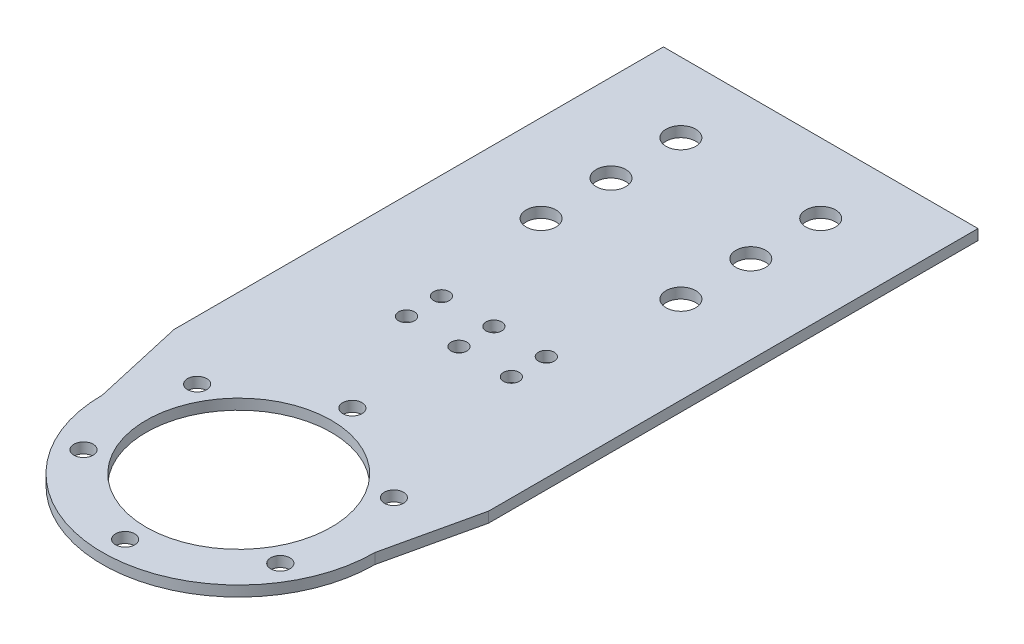
ISO-10303-21;
HEADER;
FILE_DESCRIPTION(('STEP AP214'),'2;1');
FILE_NAME('part.step','',(''),(''),'','','');
FILE_SCHEMA(('AUTOMOTIVE_DESIGN { 1 0 10303 214 1 1 1 1 }'));
ENDSEC;
DATA;
#1=APPLICATION_CONTEXT('core data for automotive mechanical design processes');
#2=APPLICATION_PROTOCOL_DEFINITION('international standard','automotive_design',2000,#1);
#3=PRODUCT_CONTEXT('',#1,'mechanical');
#4=PRODUCT('Part','Part','',(#3));
#5=PRODUCT_RELATED_PRODUCT_CATEGORY('part','',(#4));
#6=PRODUCT_DEFINITION_FORMATION('','',#4);
#7=PRODUCT_DEFINITION_CONTEXT('part definition',#1,'design');
#8=PRODUCT_DEFINITION('design','',#6,#7);
#9=PRODUCT_DEFINITION_SHAPE('','',#8);
#10=(LENGTH_UNIT() NAMED_UNIT(*) SI_UNIT(.MILLI.,.METRE.));
#11=(NAMED_UNIT(*) PLANE_ANGLE_UNIT() SI_UNIT($,.RADIAN.));
#12=(NAMED_UNIT(*) SI_UNIT($,.STERADIAN.) SOLID_ANGLE_UNIT());
#13=UNCERTAINTY_MEASURE_WITH_UNIT(LENGTH_MEASURE(1.E-05),#10,'distance_accuracy_value','');
#14=(GEOMETRIC_REPRESENTATION_CONTEXT(3) GLOBAL_UNCERTAINTY_ASSIGNED_CONTEXT((#13)) GLOBAL_UNIT_ASSIGNED_CONTEXT((#10,
#11,#12)) REPRESENTATION_CONTEXT('',''));
#15=CARTESIAN_POINT('',(0.,0.,0.));
#16=DIRECTION('',(0.,0.,1.));
#17=DIRECTION('',(1.,0.,0.));
#18=AXIS2_PLACEMENT_3D('',#15,#16,#17);
#19=CARTESIAN_POINT('',(20.,-1.5,-106.5));
#20=DIRECTION('',(0.,1.,0.));
#21=DIRECTION('',(0.,0.,1.));
#22=AXIS2_PLACEMENT_3D('',#19,#20,#21);
#23=CYLINDRICAL_SURFACE('',#22,4.25000000000001);
#24=CARTESIAN_POINT('',(20.,1.5,-106.5));
#25=DIRECTION('',(0.,1.,0.));
#26=DIRECTION('',(0.,0.,1.));
#27=AXIS2_PLACEMENT_3D('',#24,#25,#26);
#28=CIRCLE('',#27,4.25000000000001);
#29=CARTESIAN_POINT('',(20.,1.5,-102.25));
#30=VERTEX_POINT('',#29);
#31=EDGE_CURVE('E40',#30,#30,#28,.T.);
#32=ORIENTED_EDGE('',*,*,#31,.T.);
#33=EDGE_LOOP('',(#32));
#34=FACE_BOUND('',#33,.T.);
#35=CARTESIAN_POINT('',(20.,-1.5,-106.5));
#36=DIRECTION('',(0.,1.,0.));
#37=DIRECTION('',(0.,0.,1.));
#38=AXIS2_PLACEMENT_3D('',#35,#36,#37);
#39=CIRCLE('',#38,4.25000000000001);
#40=CARTESIAN_POINT('',(20.,-1.5,-102.25));
#41=VERTEX_POINT('',#40);
#42=EDGE_CURVE('E11',#41,#41,#39,.T.);
#43=ORIENTED_EDGE('',*,*,#42,.F.);
#44=EDGE_LOOP('',(#43));
#45=FACE_BOUND('',#44,.T.);
#46=ADVANCED_FACE('F33',(#34,#45),#23,.F.);
#47=CARTESIAN_POINT('',(-20.,-1.5,-106.5));
#48=DIRECTION('',(0.,1.,0.));
#49=DIRECTION('',(0.,0.,1.));
#50=AXIS2_PLACEMENT_3D('',#47,#48,#49);
#51=CYLINDRICAL_SURFACE('',#50,4.25);
#52=CARTESIAN_POINT('',(-20.,1.5,-106.5));
#53=DIRECTION('',(0.,1.,0.));
#54=DIRECTION('',(0.,0.,1.));
#55=AXIS2_PLACEMENT_3D('',#52,#53,#54);
#56=CIRCLE('',#55,4.25);
#57=CARTESIAN_POINT('',(-20.,1.5,-102.25));
#58=VERTEX_POINT('',#57);
#59=EDGE_CURVE('E135',#58,#58,#56,.T.);
#60=ORIENTED_EDGE('',*,*,#59,.T.);
#61=EDGE_LOOP('',(#60));
#62=FACE_BOUND('',#61,.T.);
#63=CARTESIAN_POINT('',(-20.,-1.5,-106.5));
#64=DIRECTION('',(0.,1.,0.));
#65=DIRECTION('',(0.,0.,1.));
#66=AXIS2_PLACEMENT_3D('',#63,#64,#65);
#67=CIRCLE('',#66,4.25);
#68=CARTESIAN_POINT('',(-20.,-1.5,-102.25));
#69=VERTEX_POINT('',#68);
#70=EDGE_CURVE('E138',#69,#69,#67,.T.);
#71=ORIENTED_EDGE('',*,*,#70,.F.);
#72=EDGE_LOOP('',(#71));
#73=FACE_BOUND('',#72,.T.);
#74=ADVANCED_FACE('F163',(#62,#73),#51,.F.);
#75=CARTESIAN_POINT('',(15.,-1.5,-63.));
#76=DIRECTION('',(0.,1.,0.));
#77=DIRECTION('',(0.,0.,1.));
#78=AXIS2_PLACEMENT_3D('',#75,#76,#77);
#79=CYLINDRICAL_SURFACE('',#78,2.25);
#80=CARTESIAN_POINT('',(15.,1.5,-63.));
#81=DIRECTION('',(0.,1.,0.));
#82=DIRECTION('',(0.,0.,1.));
#83=AXIS2_PLACEMENT_3D('',#80,#81,#82);
#84=CIRCLE('',#83,2.25);
#85=CARTESIAN_POINT('',(15.,1.5,-60.75));
#86=VERTEX_POINT('',#85);
#87=EDGE_CURVE('E129',#86,#86,#84,.T.);
#88=ORIENTED_EDGE('',*,*,#87,.T.);
#89=EDGE_LOOP('',(#88));
#90=FACE_BOUND('',#89,.T.);
#91=CARTESIAN_POINT('',(15.,-1.5,-63.));
#92=DIRECTION('',(0.,1.,0.));
#93=DIRECTION('',(0.,0.,1.));
#94=AXIS2_PLACEMENT_3D('',#91,#92,#93);
#95=CIRCLE('',#94,2.25);
#96=CARTESIAN_POINT('',(15.,-1.5,-60.75));
#97=VERTEX_POINT('',#96);
#98=EDGE_CURVE('E132',#97,#97,#95,.T.);
#99=ORIENTED_EDGE('',*,*,#98,.F.);
#100=EDGE_LOOP('',(#99));
#101=FACE_BOUND('',#100,.T.);
#102=ADVANCED_FACE('F167',(#90,#101),#79,.F.);
#103=CARTESIAN_POINT('',(0.,-1.5,-63.));
#104=DIRECTION('',(0.,1.,0.));
#105=DIRECTION('',(0.,0.,1.));
#106=AXIS2_PLACEMENT_3D('',#103,#104,#105);
#107=CYLINDRICAL_SURFACE('',#106,2.25);
#108=CARTESIAN_POINT('',(0.,1.5,-63.));
#109=DIRECTION('',(0.,1.,0.));
#110=DIRECTION('',(0.,0.,1.));
#111=AXIS2_PLACEMENT_3D('',#108,#109,#110);
#112=CIRCLE('',#111,2.25);
#113=CARTESIAN_POINT('',(0.,1.5,-60.75));
#114=VERTEX_POINT('',#113);
#115=EDGE_CURVE('E122',#114,#114,#112,.T.);
#116=ORIENTED_EDGE('',*,*,#115,.T.);
#117=EDGE_LOOP('',(#116));
#118=FACE_BOUND('',#117,.T.);
#119=CARTESIAN_POINT('',(0.,-1.5,-63.));
#120=DIRECTION('',(0.,1.,0.));
#121=DIRECTION('',(0.,0.,1.));
#122=AXIS2_PLACEMENT_3D('',#119,#120,#121);
#123=CIRCLE('',#122,2.25);
#124=CARTESIAN_POINT('',(0.,-1.5,-60.75));
#125=VERTEX_POINT('',#124);
#126=EDGE_CURVE('E126',#125,#125,#123,.T.);
#127=ORIENTED_EDGE('',*,*,#126,.F.);
#128=EDGE_LOOP('',(#127));
#129=FACE_BOUND('',#128,.T.);
#130=ADVANCED_FACE('F157',(#118,#129),#107,.F.);
#131=CARTESIAN_POINT('',(0.,1.5,0.));
#132=DIRECTION('',(0.,-1.,0.));
#133=DIRECTION('',(0.,0.,-1.));
#134=AXIS2_PLACEMENT_3D('',#131,#132,#133);
#135=CYLINDRICAL_SURFACE('',#134,39.);
#136=DIRECTION('',(0.,-1.,0.));
#137=VECTOR('',#136,1.);
#138=CARTESIAN_POINT('',(-39.,1.5,2.72335544429764E-13));
#139=LINE('',#138,#137);
#140=CARTESIAN_POINT('',(-39.,1.5,2.70616862252382E-13));
#141=VERTEX_POINT('',#140);
#142=CARTESIAN_POINT('',(-39.,-1.5,2.70616862252382E-13));
#143=VERTEX_POINT('',#142);
#144=EDGE_CURVE('E114',#141,#143,#139,.T.);
#145=ORIENTED_EDGE('',*,*,#144,.T.);
#146=CARTESIAN_POINT('',(0.,-1.5,0.));
#147=DIRECTION('',(0.,1.,0.));
#148=DIRECTION('',(0.,0.,1.));
#149=AXIS2_PLACEMENT_3D('',#146,#147,#148);
#150=CIRCLE('',#149,39.);
#151=CARTESIAN_POINT('',(39.,-1.5,0.));
#152=VERTEX_POINT('',#151);
#153=EDGE_CURVE('E119',#143,#152,#150,.T.);
#154=ORIENTED_EDGE('',*,*,#153,.T.);
#155=DIRECTION('',(0.,-1.,0.));
#156=VECTOR('',#155,1.);
#157=CARTESIAN_POINT('',(39.,1.5,0.));
#158=LINE('',#157,#156);
#159=CARTESIAN_POINT('',(39.,1.5,0.));
#160=VERTEX_POINT('',#159);
#161=EDGE_CURVE('E47',#160,#152,#158,.T.);
#162=ORIENTED_EDGE('',*,*,#161,.F.);
#163=CARTESIAN_POINT('',(0.,1.5,0.));
#164=DIRECTION('',(0.,1.,0.));
#165=DIRECTION('',(0.,0.,1.));
#166=AXIS2_PLACEMENT_3D('',#163,#164,#165);
#167=CIRCLE('',#166,39.);
#168=EDGE_CURVE('E51',#141,#160,#167,.T.);
#169=ORIENTED_EDGE('',*,*,#168,.F.);
#170=EDGE_LOOP('',(#145,#154,#162,#169));
#171=FACE_BOUND('',#170,.T.);
#172=ADVANCED_FACE('F147',(#171),#135,.T.);
#173=CARTESIAN_POINT('',(0.,1.5,0.));
#174=DIRECTION('',(0.,1.,0.));
#175=DIRECTION('',(0.,0.,1.));
#176=AXIS2_PLACEMENT_3D('',#173,#174,#175);
#177=PLANE('',#176);
#178=CARTESIAN_POINT('',(20.,1.5,-126.5));
#179=DIRECTION('',(0.,1.,0.));
#180=DIRECTION('',(0.,0.,1.));
#181=AXIS2_PLACEMENT_3D('',#178,#179,#180);
#182=CIRCLE('',#181,4.25000000000001);
#183=CARTESIAN_POINT('',(20.,1.5,-122.25));
#184=VERTEX_POINT('',#183);
#185=EDGE_CURVE('E422',#184,#184,#182,.T.);
#186=ORIENTED_EDGE('',*,*,#185,.F.);
#187=EDGE_LOOP('',(#186));
#188=FACE_BOUND('',#187,.T.);
#189=CARTESIAN_POINT('',(-20.,1.5,-126.5));
#190=DIRECTION('',(0.,1.,0.));
#191=DIRECTION('',(0.,0.,1.));
#192=AXIS2_PLACEMENT_3D('',#189,#190,#191);
#193=CIRCLE('',#192,4.25);
#194=CARTESIAN_POINT('',(-20.,1.5,-122.25));
#195=VERTEX_POINT('',#194);
#196=EDGE_CURVE('E426',#195,#195,#193,.T.);
#197=ORIENTED_EDGE('',*,*,#196,.F.);
#198=EDGE_LOOP('',(#197));
#199=FACE_BOUND('',#198,.T.);
#200=CARTESIAN_POINT('',(-20.,1.5,-146.5));
#201=DIRECTION('',(0.,1.,0.));
#202=DIRECTION('',(0.,0.,1.));
#203=AXIS2_PLACEMENT_3D('',#200,#201,#202);
#204=CIRCLE('',#203,4.25);
#205=CARTESIAN_POINT('',(-20.,1.5,-142.25));
#206=VERTEX_POINT('',#205);
#207=EDGE_CURVE('E444',#206,#206,#204,.T.);
#208=ORIENTED_EDGE('',*,*,#207,.F.);
#209=EDGE_LOOP('',(#208));
#210=FACE_BOUND('',#209,.T.);
#211=CARTESIAN_POINT('',(20.,1.5,-146.5));
#212=DIRECTION('',(0.,1.,0.));
#213=DIRECTION('',(0.,0.,1.));
#214=AXIS2_PLACEMENT_3D('',#211,#212,#213);
#215=CIRCLE('',#214,4.25000000000001);
#216=CARTESIAN_POINT('',(20.,1.5,-142.25));
#217=VERTEX_POINT('',#216);
#218=EDGE_CURVE('E439',#217,#217,#215,.T.);
#219=ORIENTED_EDGE('',*,*,#218,.F.);
#220=EDGE_LOOP('',(#219));
#221=FACE_BOUND('',#220,.T.);
#222=CARTESIAN_POINT('',(-15.,1.5,-73.));
#223=DIRECTION('',(0.,1.,0.));
#224=DIRECTION('',(0.,0.,1.));
#225=AXIS2_PLACEMENT_3D('',#222,#223,#224);
#226=CIRCLE('',#225,2.25);
#227=CARTESIAN_POINT('',(-15.,1.5,-70.75));
#228=VERTEX_POINT('',#227);
#229=EDGE_CURVE('E456',#228,#228,#226,.T.);
#230=ORIENTED_EDGE('',*,*,#229,.F.);
#231=EDGE_LOOP('',(#230));
#232=FACE_BOUND('',#231,.T.);
#233=CARTESIAN_POINT('',(-15.,1.5,-63.));
#234=DIRECTION('',(0.,1.,0.));
#235=DIRECTION('',(0.,0.,1.));
#236=AXIS2_PLACEMENT_3D('',#233,#234,#235);
#237=CIRCLE('',#236,2.25);
#238=CARTESIAN_POINT('',(-15.,1.5,-60.75));
#239=VERTEX_POINT('',#238);
#240=EDGE_CURVE('E451',#239,#239,#237,.T.);
#241=ORIENTED_EDGE('',*,*,#240,.F.);
#242=EDGE_LOOP('',(#241));
#243=FACE_BOUND('',#242,.T.);
#244=CARTESIAN_POINT('',(15.,1.5,-73.));
#245=DIRECTION('',(0.,1.,0.));
#246=DIRECTION('',(0.,0.,1.));
#247=AXIS2_PLACEMENT_3D('',#244,#245,#246);
#248=CIRCLE('',#247,2.25);
#249=CARTESIAN_POINT('',(15.,1.5,-70.75));
#250=VERTEX_POINT('',#249);
#251=EDGE_CURVE('E459',#250,#250,#248,.T.);
#252=ORIENTED_EDGE('',*,*,#251,.F.);
#253=EDGE_LOOP('',(#252));
#254=FACE_BOUND('',#253,.T.);
#255=CARTESIAN_POINT('',(0.,1.5,-73.));
#256=DIRECTION('',(0.,1.,0.));
#257=DIRECTION('',(0.,0.,1.));
#258=AXIS2_PLACEMENT_3D('',#255,#256,#257);
#259=CIRCLE('',#258,2.25);
#260=CARTESIAN_POINT('',(0.,1.5,-70.75));
#261=VERTEX_POINT('',#260);
#262=EDGE_CURVE('E468',#261,#261,#259,.T.);
#263=ORIENTED_EDGE('',*,*,#262,.F.);
#264=EDGE_LOOP('',(#263));
#265=FACE_BOUND('',#264,.T.);
#266=CARTESIAN_POINT('',(28.1458256229941,1.5,-16.2500000000003));
#267=DIRECTION('',(0.,1.,0.));
#268=DIRECTION('',(-0.866025403784433,0.,0.50000000000001));
#269=AXIS2_PLACEMENT_3D('',#266,#267,#268);
#270=CIRCLE('',#269,2.75);
#271=CARTESIAN_POINT('',(25.7642557625869,1.5,-14.8750000000003));
#272=VERTEX_POINT('',#271);
#273=EDGE_CURVE('E471',#272,#272,#270,.T.);
#274=ORIENTED_EDGE('',*,*,#273,.F.);
#275=EDGE_LOOP('',(#274));
#276=FACE_BOUND('',#275,.T.);
#277=CARTESIAN_POINT('',(28.1458256229944,1.5,16.2499999999997));
#278=DIRECTION('',(0.,1.,0.));
#279=DIRECTION('',(-0.866025403784443,0.,-0.499999999999992));
#280=AXIS2_PLACEMENT_3D('',#277,#278,#279);
#281=CIRCLE('',#280,2.75);
#282=CARTESIAN_POINT('',(25.7642557625872,1.5,14.8749999999998));
#283=VERTEX_POINT('',#282);
#284=EDGE_CURVE('E486',#283,#283,#281,.T.);
#285=ORIENTED_EDGE('',*,*,#284,.F.);
#286=EDGE_LOOP('',(#285));
#287=FACE_BOUND('',#286,.T.);
#288=CARTESIAN_POINT('',(0.,1.5,32.5));
#289=DIRECTION('',(0.,1.,0.));
#290=DIRECTION('',(0.,0.,-1.));
#291=AXIS2_PLACEMENT_3D('',#288,#289,#290);
#292=CIRCLE('',#291,2.75);
#293=CARTESIAN_POINT('',(0.,1.5,29.75));
#294=VERTEX_POINT('',#293);
#295=EDGE_CURVE('E480',#294,#294,#292,.T.);
#296=ORIENTED_EDGE('',*,*,#295,.F.);
#297=EDGE_LOOP('',(#296));
#298=FACE_BOUND('',#297,.T.);
#299=CARTESIAN_POINT('',(-28.1458256229942,1.5,16.2500000000001));
#300=DIRECTION('',(0.,1.,0.));
#301=DIRECTION('',(0.866025403784436,0.,-0.500000000000004));
#302=AXIS2_PLACEMENT_3D('',#299,#300,#301);
#303=CIRCLE('',#302,2.75);
#304=CARTESIAN_POINT('',(-25.764255762587,1.5,14.8750000000001));
#305=VERTEX_POINT('',#304);
#306=EDGE_CURVE('E472',#305,#305,#303,.T.);
#307=ORIENTED_EDGE('',*,*,#306,.F.);
#308=EDGE_LOOP('',(#307));
#309=FACE_BOUND('',#308,.T.);
#310=CARTESIAN_POINT('',(-28.1458256229943,1.5,-16.2499999999999));
#311=DIRECTION('',(0.,1.,0.));
#312=DIRECTION('',(0.86602540378444,0.,0.499999999999998));
#313=AXIS2_PLACEMENT_3D('',#310,#311,#312);
#314=CIRCLE('',#313,2.75);
#315=CARTESIAN_POINT('',(-25.7642557625871,1.5,-14.8749999999999));
#316=VERTEX_POINT('',#315);
#317=EDGE_CURVE('E479',#316,#316,#314,.T.);
#318=ORIENTED_EDGE('',*,*,#317,.F.);
#319=EDGE_LOOP('',(#318));
#320=FACE_BOUND('',#319,.T.);
#321=CARTESIAN_POINT('',(0.,1.5,-32.5));
#322=DIRECTION('',(0.,1.,0.));
#323=DIRECTION('',(0.,0.,1.));
#324=AXIS2_PLACEMENT_3D('',#321,#322,#323);
#325=CIRCLE('',#324,2.75);
#326=CARTESIAN_POINT('',(0.,1.5,-29.75));
#327=VERTEX_POINT('',#326);
#328=EDGE_CURVE('E501',#327,#327,#325,.T.);
#329=ORIENTED_EDGE('',*,*,#328,.F.);
#330=EDGE_LOOP('',(#329));
#331=FACE_BOUND('',#330,.T.);
#332=DIRECTION('',(0.220825652597793,0.,0.975313298973596));
#333=VECTOR('',#332,1.);
#334=CARTESIAN_POINT('',(-45.,1.5,-26.5));
#335=LINE('',#334,#333);
#336=CARTESIAN_POINT('',(-45.,1.5,-26.5));
#337=VERTEX_POINT('',#336);
#338=EDGE_CURVE('E93',#337,#141,#335,.T.);
#339=ORIENTED_EDGE('',*,*,#338,.T.);
#340=ORIENTED_EDGE('',*,*,#168,.T.);
#341=DIRECTION('',(0.220825652597795,0.,-0.975313298973595));
#342=VECTOR('',#341,1.);
#343=CARTESIAN_POINT('',(45.,1.5,-26.5));
#344=LINE('',#343,#342);
#345=CARTESIAN_POINT('',(45.,1.5,-26.5));
#346=VERTEX_POINT('',#345);
#347=EDGE_CURVE('E508',#160,#346,#344,.T.);
#348=ORIENTED_EDGE('',*,*,#347,.T.);
#349=DIRECTION('',(0.,0.,-1.));
#350=VECTOR('',#349,1.);
#351=CARTESIAN_POINT('',(45.,1.5,-166.5));
#352=LINE('',#351,#350);
#353=CARTESIAN_POINT('',(45.,1.5,-166.5));
#354=VERTEX_POINT('',#353);
#355=EDGE_CURVE('E100',#346,#354,#352,.T.);
#356=ORIENTED_EDGE('',*,*,#355,.T.);
#357=DIRECTION('',(-1.,0.,0.));
#358=VECTOR('',#357,1.);
#359=CARTESIAN_POINT('',(-45.,1.5,-166.5));
#360=LINE('',#359,#358);
#361=CARTESIAN_POINT('',(-45.,1.5,-166.5));
#362=VERTEX_POINT('',#361);
#363=EDGE_CURVE('E94',#354,#362,#360,.T.);
#364=ORIENTED_EDGE('',*,*,#363,.T.);
#365=DIRECTION('',(0.,0.,1.));
#366=VECTOR('',#365,1.);
#367=CARTESIAN_POINT('',(-45.,1.5,-166.5));
#368=LINE('',#367,#366);
#369=EDGE_CURVE('E83',#362,#337,#368,.T.);
#370=ORIENTED_EDGE('',*,*,#369,.T.);
#371=EDGE_LOOP('',(#339,#340,#348,#356,#364,#370));
#372=FACE_BOUND('',#371,.T.);
#373=CARTESIAN_POINT('',(0.,1.5,0.));
#374=DIRECTION('',(0.,1.,0.));
#375=DIRECTION('',(0.,0.,1.));
#376=AXIS2_PLACEMENT_3D('',#373,#374,#375);
#377=CIRCLE('',#376,26.5);
#378=CARTESIAN_POINT('',(0.,1.5,26.5));
#379=VERTEX_POINT('',#378);
#380=EDGE_CURVE('E112',#379,#379,#377,.T.);
#381=ORIENTED_EDGE('',*,*,#380,.F.);
#382=EDGE_LOOP('',(#381));
#383=FACE_BOUND('',#382,.T.);
#384=ORIENTED_EDGE('',*,*,#115,.F.);
#385=EDGE_LOOP('',(#384));
#386=FACE_BOUND('',#385,.T.);
#387=ORIENTED_EDGE('',*,*,#87,.F.);
#388=EDGE_LOOP('',(#387));
#389=FACE_BOUND('',#388,.T.);
#390=ORIENTED_EDGE('',*,*,#59,.F.);
#391=EDGE_LOOP('',(#390));
#392=FACE_BOUND('',#391,.T.);
#393=ORIENTED_EDGE('',*,*,#31,.F.);
#394=EDGE_LOOP('',(#393));
#395=FACE_BOUND('',#394,.T.);
#396=ADVANCED_FACE('F97',(#188,#199,#210,#221,#232,#243,#254,#265,#276,#287,#298,#309,#320,#331,
#372,#383,#386,#389,#392,#395),#177,.T.);
#397=CARTESIAN_POINT('',(0.,-1.5,0.));
#398=DIRECTION('',(0.,1.,0.));
#399=DIRECTION('',(0.,0.,1.));
#400=AXIS2_PLACEMENT_3D('',#397,#398,#399);
#401=PLANE('',#400);
#402=CARTESIAN_POINT('',(20.,-1.5,-126.5));
#403=DIRECTION('',(0.,1.,0.));
#404=DIRECTION('',(0.,0.,1.));
#405=AXIS2_PLACEMENT_3D('',#402,#403,#404);
#406=CIRCLE('',#405,4.25000000000001);
#407=CARTESIAN_POINT('',(20.,-1.5,-122.25));
#408=VERTEX_POINT('',#407);
#409=EDGE_CURVE('E425',#408,#408,#406,.T.);
#410=ORIENTED_EDGE('',*,*,#409,.T.);
#411=EDGE_LOOP('',(#410));
#412=FACE_BOUND('',#411,.T.);
#413=CARTESIAN_POINT('',(-20.,-1.5,-126.5));
#414=DIRECTION('',(0.,1.,0.));
#415=DIRECTION('',(0.,0.,1.));
#416=AXIS2_PLACEMENT_3D('',#413,#414,#415);
#417=CIRCLE('',#416,4.25);
#418=CARTESIAN_POINT('',(-20.,-1.5,-122.25));
#419=VERTEX_POINT('',#418);
#420=EDGE_CURVE('E429',#419,#419,#417,.T.);
#421=ORIENTED_EDGE('',*,*,#420,.T.);
#422=EDGE_LOOP('',(#421));
#423=FACE_BOUND('',#422,.T.);
#424=CARTESIAN_POINT('',(-20.,-1.5,-146.5));
#425=DIRECTION('',(0.,1.,0.));
#426=DIRECTION('',(0.,0.,1.));
#427=AXIS2_PLACEMENT_3D('',#424,#425,#426);
#428=CIRCLE('',#427,4.25);
#429=CARTESIAN_POINT('',(-20.,-1.5,-142.25));
#430=VERTEX_POINT('',#429);
#431=EDGE_CURVE('E436',#430,#430,#428,.T.);
#432=ORIENTED_EDGE('',*,*,#431,.T.);
#433=EDGE_LOOP('',(#432));
#434=FACE_BOUND('',#433,.T.);
#435=CARTESIAN_POINT('',(20.,-1.5,-146.5));
#436=DIRECTION('',(0.,1.,0.));
#437=DIRECTION('',(0.,0.,1.));
#438=AXIS2_PLACEMENT_3D('',#435,#436,#437);
#439=CIRCLE('',#438,4.25000000000001);
#440=CARTESIAN_POINT('',(20.,-1.5,-142.25));
#441=VERTEX_POINT('',#440);
#442=EDGE_CURVE('E435',#441,#441,#439,.T.);
#443=ORIENTED_EDGE('',*,*,#442,.T.);
#444=EDGE_LOOP('',(#443));
#445=FACE_BOUND('',#444,.T.);
#446=CARTESIAN_POINT('',(-15.,-1.5,-73.));
#447=DIRECTION('',(0.,1.,0.));
#448=DIRECTION('',(0.,0.,1.));
#449=AXIS2_PLACEMENT_3D('',#446,#447,#448);
#450=CIRCLE('',#449,2.25);
#451=CARTESIAN_POINT('',(-15.,-1.5,-70.75));
#452=VERTEX_POINT('',#451);
#453=EDGE_CURVE('E448',#452,#452,#450,.T.);
#454=ORIENTED_EDGE('',*,*,#453,.T.);
#455=EDGE_LOOP('',(#454));
#456=FACE_BOUND('',#455,.T.);
#457=CARTESIAN_POINT('',(-15.,-1.5,-63.));
#458=DIRECTION('',(0.,1.,0.));
#459=DIRECTION('',(0.,0.,1.));
#460=AXIS2_PLACEMENT_3D('',#457,#458,#459);
#461=CIRCLE('',#460,2.25);
#462=CARTESIAN_POINT('',(-15.,-1.5,-60.75));
#463=VERTEX_POINT('',#462);
#464=EDGE_CURVE('E447',#463,#463,#461,.T.);
#465=ORIENTED_EDGE('',*,*,#464,.T.);
#466=EDGE_LOOP('',(#465));
#467=FACE_BOUND('',#466,.T.);
#468=CARTESIAN_POINT('',(15.,-1.5,-73.));
#469=DIRECTION('',(0.,1.,0.));
#470=DIRECTION('',(0.,0.,1.));
#471=AXIS2_PLACEMENT_3D('',#468,#469,#470);
#472=CIRCLE('',#471,2.25);
#473=CARTESIAN_POINT('',(15.,-1.5,-70.75));
#474=VERTEX_POINT('',#473);
#475=EDGE_CURVE('E462',#474,#474,#472,.T.);
#476=ORIENTED_EDGE('',*,*,#475,.T.);
#477=EDGE_LOOP('',(#476));
#478=FACE_BOUND('',#477,.T.);
#479=CARTESIAN_POINT('',(0.,-1.5,-73.));
#480=DIRECTION('',(0.,1.,0.));
#481=DIRECTION('',(0.,0.,1.));
#482=AXIS2_PLACEMENT_3D('',#479,#480,#481);
#483=CIRCLE('',#482,2.25);
#484=CARTESIAN_POINT('',(0.,-1.5,-70.75));
#485=VERTEX_POINT('',#484);
#486=EDGE_CURVE('E465',#485,#485,#483,.T.);
#487=ORIENTED_EDGE('',*,*,#486,.T.);
#488=EDGE_LOOP('',(#487));
#489=FACE_BOUND('',#488,.T.);
#490=CARTESIAN_POINT('',(28.1458256229941,-1.5,-16.2500000000003));
#491=DIRECTION('',(0.,1.,0.));
#492=DIRECTION('',(-0.866025403784433,0.,0.50000000000001));
#493=AXIS2_PLACEMENT_3D('',#490,#491,#492);
#494=CIRCLE('',#493,2.75);
#495=CARTESIAN_POINT('',(25.7642557625869,-1.5,-14.8750000000003));
#496=VERTEX_POINT('',#495);
#497=EDGE_CURVE('E489',#496,#496,#494,.T.);
#498=ORIENTED_EDGE('',*,*,#497,.T.);
#499=EDGE_LOOP('',(#498));
#500=FACE_BOUND('',#499,.T.);
#501=CARTESIAN_POINT('',(28.1458256229944,-1.5,16.2499999999997));
#502=DIRECTION('',(0.,1.,0.));
#503=DIRECTION('',(-0.866025403784443,0.,-0.499999999999992));
#504=AXIS2_PLACEMENT_3D('',#501,#502,#503);
#505=CIRCLE('',#504,2.75);
#506=CARTESIAN_POINT('',(25.7642557625872,-1.5,14.8749999999998));
#507=VERTEX_POINT('',#506);
#508=EDGE_CURVE('E483',#507,#507,#505,.T.);
#509=ORIENTED_EDGE('',*,*,#508,.T.);
#510=EDGE_LOOP('',(#509));
#511=FACE_BOUND('',#510,.T.);
#512=CARTESIAN_POINT('',(0.,-1.5,32.5));
#513=DIRECTION('',(0.,1.,0.));
#514=DIRECTION('',(0.,0.,-1.));
#515=AXIS2_PLACEMENT_3D('',#512,#513,#514);
#516=CIRCLE('',#515,2.75);
#517=CARTESIAN_POINT('',(0.,-1.5,29.75));
#518=VERTEX_POINT('',#517);
#519=EDGE_CURVE('E476',#518,#518,#516,.T.);
#520=ORIENTED_EDGE('',*,*,#519,.T.);
#521=EDGE_LOOP('',(#520));
#522=FACE_BOUND('',#521,.T.);
#523=CARTESIAN_POINT('',(-28.1458256229942,-1.5,16.2500000000001));
#524=DIRECTION('',(0.,1.,0.));
#525=DIRECTION('',(0.866025403784436,0.,-0.500000000000004));
#526=AXIS2_PLACEMENT_3D('',#523,#524,#525);
#527=CIRCLE('',#526,2.75);
#528=CARTESIAN_POINT('',(-25.764255762587,-1.5,14.8750000000001));
#529=VERTEX_POINT('',#528);
#530=EDGE_CURVE('E475',#529,#529,#527,.T.);
#531=ORIENTED_EDGE('',*,*,#530,.T.);
#532=EDGE_LOOP('',(#531));
#533=FACE_BOUND('',#532,.T.);
#534=CARTESIAN_POINT('',(-28.1458256229943,-1.5,-16.2499999999999));
#535=DIRECTION('',(0.,1.,0.));
#536=DIRECTION('',(0.86602540378444,0.,0.499999999999998));
#537=AXIS2_PLACEMENT_3D('',#534,#535,#536);
#538=CIRCLE('',#537,2.75);
#539=CARTESIAN_POINT('',(-25.7642557625871,-1.5,-14.8749999999999));
#540=VERTEX_POINT('',#539);
#541=EDGE_CURVE('E498',#540,#540,#538,.T.);
#542=ORIENTED_EDGE('',*,*,#541,.T.);
#543=EDGE_LOOP('',(#542));
#544=FACE_BOUND('',#543,.T.);
#545=CARTESIAN_POINT('',(0.,-1.5,-32.5));
#546=DIRECTION('',(0.,1.,0.));
#547=DIRECTION('',(0.,0.,1.));
#548=AXIS2_PLACEMENT_3D('',#545,#546,#547);
#549=CIRCLE('',#548,2.75);
#550=CARTESIAN_POINT('',(0.,-1.5,-29.75));
#551=VERTEX_POINT('',#550);
#552=EDGE_CURVE('E504',#551,#551,#549,.T.);
#553=ORIENTED_EDGE('',*,*,#552,.T.);
#554=EDGE_LOOP('',(#553));
#555=FACE_BOUND('',#554,.T.);
#556=ORIENTED_EDGE('',*,*,#153,.F.);
#557=DIRECTION('',(0.220825652597793,0.,0.975313298973596));
#558=VECTOR('',#557,1.);
#559=CARTESIAN_POINT('',(-45.,-1.5,-26.5));
#560=LINE('',#559,#558);
#561=CARTESIAN_POINT('',(-45.,-1.5,-26.5));
#562=VERTEX_POINT('',#561);
#563=EDGE_CURVE('E515',#562,#143,#560,.T.);
#564=ORIENTED_EDGE('',*,*,#563,.F.);
#565=DIRECTION('',(0.,0.,1.));
#566=VECTOR('',#565,1.);
#567=CARTESIAN_POINT('',(-45.,-1.5,-166.5));
#568=LINE('',#567,#566);
#569=CARTESIAN_POINT('',(-45.,-1.5,-166.5));
#570=VERTEX_POINT('',#569);
#571=EDGE_CURVE('E513',#570,#562,#568,.T.);
#572=ORIENTED_EDGE('',*,*,#571,.F.);
#573=DIRECTION('',(-1.,0.,0.));
#574=VECTOR('',#573,1.);
#575=CARTESIAN_POINT('',(-45.,-1.5,-166.5));
#576=LINE('',#575,#574);
#577=CARTESIAN_POINT('',(45.,-1.5,-166.5));
#578=VERTEX_POINT('',#577);
#579=EDGE_CURVE('E108',#578,#570,#576,.T.);
#580=ORIENTED_EDGE('',*,*,#579,.F.);
#581=DIRECTION('',(0.,0.,-1.));
#582=VECTOR('',#581,1.);
#583=CARTESIAN_POINT('',(45.,-1.5,-166.5));
#584=LINE('',#583,#582);
#585=CARTESIAN_POINT('',(45.,-1.5,-26.5));
#586=VERTEX_POINT('',#585);
#587=EDGE_CURVE('E104',#586,#578,#584,.T.);
#588=ORIENTED_EDGE('',*,*,#587,.F.);
#589=DIRECTION('',(0.220825652597795,0.,-0.975313298973595));
#590=VECTOR('',#589,1.);
#591=CARTESIAN_POINT('',(45.,-1.5,-26.5));
#592=LINE('',#591,#590);
#593=EDGE_CURVE('E518',#152,#586,#592,.T.);
#594=ORIENTED_EDGE('',*,*,#593,.F.);
#595=EDGE_LOOP('',(#556,#564,#572,#580,#588,#594));
#596=FACE_BOUND('',#595,.T.);
#597=CARTESIAN_POINT('',(0.,-1.5,0.));
#598=DIRECTION('',(0.,1.,0.));
#599=DIRECTION('',(0.,0.,1.));
#600=AXIS2_PLACEMENT_3D('',#597,#598,#599);
#601=CIRCLE('',#600,26.5);
#602=CARTESIAN_POINT('',(0.,-1.5,26.5));
#603=VERTEX_POINT('',#602);
#604=EDGE_CURVE('E109',#603,#603,#601,.T.);
#605=ORIENTED_EDGE('',*,*,#604,.T.);
#606=EDGE_LOOP('',(#605));
#607=FACE_BOUND('',#606,.T.);
#608=ORIENTED_EDGE('',*,*,#126,.T.);
#609=EDGE_LOOP('',(#608));
#610=FACE_BOUND('',#609,.T.);
#611=ORIENTED_EDGE('',*,*,#98,.T.);
#612=EDGE_LOOP('',(#611));
#613=FACE_BOUND('',#612,.T.);
#614=ORIENTED_EDGE('',*,*,#70,.T.);
#615=EDGE_LOOP('',(#614));
#616=FACE_BOUND('',#615,.T.);
#617=ORIENTED_EDGE('',*,*,#42,.T.);
#618=EDGE_LOOP('',(#617));
#619=FACE_BOUND('',#618,.T.);
#620=ADVANCED_FACE('F146',(#412,#423,#434,#445,#456,#467,#478,#489,#500,#511,#522,#533,#544,
#555,#596,#607,#610,#613,#616,#619),#401,.F.);
#621=CARTESIAN_POINT('',(0.,1.5,0.));
#622=DIRECTION('',(0.,-1.,0.));
#623=DIRECTION('',(0.,0.,-1.));
#624=AXIS2_PLACEMENT_3D('',#621,#622,#623);
#625=CYLINDRICAL_SURFACE('',#624,26.5);
#626=ORIENTED_EDGE('',*,*,#604,.F.);
#627=EDGE_LOOP('',(#626));
#628=FACE_BOUND('',#627,.T.);
#629=ORIENTED_EDGE('',*,*,#380,.T.);
#630=EDGE_LOOP('',(#629));
#631=FACE_BOUND('',#630,.T.);
#632=ADVANCED_FACE('F154',(#628,#631),#625,.F.);
#633=CARTESIAN_POINT('',(-45.,1.5,-166.5));
#634=DIRECTION('',(0.,0.,1.));
#635=DIRECTION('',(1.,0.,0.));
#636=AXIS2_PLACEMENT_3D('',#633,#634,#635);
#637=PLANE('',#636);
#638=ORIENTED_EDGE('',*,*,#579,.T.);
#639=DIRECTION('',(0.,-1.,0.));
#640=VECTOR('',#639,1.);
#641=CARTESIAN_POINT('',(-45.,1.5,-166.5));
#642=LINE('',#641,#640);
#643=EDGE_CURVE('E87',#362,#570,#642,.T.);
#644=ORIENTED_EDGE('',*,*,#643,.F.);
#645=ORIENTED_EDGE('',*,*,#363,.F.);
#646=DIRECTION('',(0.,-1.,0.));
#647=VECTOR('',#646,1.);
#648=CARTESIAN_POINT('',(45.,1.5,-166.5));
#649=LINE('',#648,#647);
#650=EDGE_CURVE('E511',#354,#578,#649,.T.);
#651=ORIENTED_EDGE('',*,*,#650,.T.);
#652=EDGE_LOOP('',(#638,#644,#645,#651));
#653=FACE_BOUND('',#652,.T.);
#654=ADVANCED_FACE('F106',(#653),#637,.F.);
#655=CARTESIAN_POINT('',(-45.,1.5,-166.5));
#656=DIRECTION('',(1.,0.,0.));
#657=DIRECTION('',(0.,0.,-1.));
#658=AXIS2_PLACEMENT_3D('',#655,#656,#657);
#659=PLANE('',#658);
#660=ORIENTED_EDGE('',*,*,#571,.T.);
#661=DIRECTION('',(0.,-1.,0.));
#662=VECTOR('',#661,1.);
#663=CARTESIAN_POINT('',(-45.,1.5,-26.5));
#664=LINE('',#663,#662);
#665=EDGE_CURVE('E90',#337,#562,#664,.T.);
#666=ORIENTED_EDGE('',*,*,#665,.F.);
#667=ORIENTED_EDGE('',*,*,#369,.F.);
#668=ORIENTED_EDGE('',*,*,#643,.T.);
#669=EDGE_LOOP('',(#660,#666,#667,#668));
#670=FACE_BOUND('',#669,.T.);
#671=ADVANCED_FACE('F85',(#670),#659,.F.);
#672=CARTESIAN_POINT('',(-45.,1.5,-26.5));
#673=DIRECTION('',(0.975313298973596,0.,-0.220825652597793));
#674=DIRECTION('',(-0.220825652597793,0.,-0.975313298973596));
#675=AXIS2_PLACEMENT_3D('',#672,#673,#674);
#676=PLANE('',#675);
#677=ORIENTED_EDGE('',*,*,#563,.T.);
#678=ORIENTED_EDGE('',*,*,#144,.F.);
#679=ORIENTED_EDGE('',*,*,#338,.F.);
#680=ORIENTED_EDGE('',*,*,#665,.T.);
#681=EDGE_LOOP('',(#677,#678,#679,#680));
#682=FACE_BOUND('',#681,.T.);
#683=ADVANCED_FACE('F233',(#682),#676,.F.);
#684=CARTESIAN_POINT('',(45.,1.5,-26.5));
#685=DIRECTION('',(-0.975313298973595,0.,-0.220825652597795));
#686=DIRECTION('',(-0.220825652597795,0.,0.975313298973596));
#687=AXIS2_PLACEMENT_3D('',#684,#685,#686);
#688=PLANE('',#687);
#689=ORIENTED_EDGE('',*,*,#593,.T.);
#690=DIRECTION('',(0.,-1.,0.));
#691=VECTOR('',#690,1.);
#692=CARTESIAN_POINT('',(45.,1.5,-26.5));
#693=LINE('',#692,#691);
#694=EDGE_CURVE('E522',#346,#586,#693,.T.);
#695=ORIENTED_EDGE('',*,*,#694,.F.);
#696=ORIENTED_EDGE('',*,*,#347,.F.);
#697=ORIENTED_EDGE('',*,*,#161,.T.);
#698=EDGE_LOOP('',(#689,#695,#696,#697));
#699=FACE_BOUND('',#698,.T.);
#700=ADVANCED_FACE('F242',(#699),#688,.F.);
#701=CARTESIAN_POINT('',(45.,1.5,-166.5));
#702=DIRECTION('',(-1.,0.,0.));
#703=DIRECTION('',(0.,0.,1.));
#704=AXIS2_PLACEMENT_3D('',#701,#702,#703);
#705=PLANE('',#704);
#706=ORIENTED_EDGE('',*,*,#587,.T.);
#707=ORIENTED_EDGE('',*,*,#650,.F.);
#708=ORIENTED_EDGE('',*,*,#355,.F.);
#709=ORIENTED_EDGE('',*,*,#694,.T.);
#710=EDGE_LOOP('',(#706,#707,#708,#709));
#711=FACE_BOUND('',#710,.T.);
#712=ADVANCED_FACE('F252',(#711),#705,.F.);
#713=CARTESIAN_POINT('',(0.,-1.5,-32.5));
#714=DIRECTION('',(0.,1.,0.));
#715=DIRECTION('',(0.,0.,1.));
#716=AXIS2_PLACEMENT_3D('',#713,#714,#715);
#717=CYLINDRICAL_SURFACE('',#716,2.75);
#718=ORIENTED_EDGE('',*,*,#552,.F.);
#719=EDGE_LOOP('',(#718));
#720=FACE_BOUND('',#719,.T.);
#721=ORIENTED_EDGE('',*,*,#328,.T.);
#722=EDGE_LOOP('',(#721));
#723=FACE_BOUND('',#722,.T.);
#724=ADVANCED_FACE('F262',(#720,#723),#717,.F.);
#725=CARTESIAN_POINT('',(-28.1458256229943,-1.5,-16.2499999999999));
#726=DIRECTION('',(0.,1.,0.));
#727=DIRECTION('',(0.,0.,1.));
#728=AXIS2_PLACEMENT_3D('',#725,#726,#727);
#729=CYLINDRICAL_SURFACE('',#728,2.75);
#730=ORIENTED_EDGE('',*,*,#541,.F.);
#731=EDGE_LOOP('',(#730));
#732=FACE_BOUND('',#731,.T.);
#733=ORIENTED_EDGE('',*,*,#317,.T.);
#734=EDGE_LOOP('',(#733));
#735=FACE_BOUND('',#734,.T.);
#736=ADVANCED_FACE('F272',(#732,#735),#729,.F.);
#737=CARTESIAN_POINT('',(-28.1458256229942,-1.5,16.2500000000001));
#738=DIRECTION('',(0.,1.,0.));
#739=DIRECTION('',(0.,0.,1.));
#740=AXIS2_PLACEMENT_3D('',#737,#738,#739);
#741=CYLINDRICAL_SURFACE('',#740,2.75);
#742=ORIENTED_EDGE('',*,*,#530,.F.);
#743=EDGE_LOOP('',(#742));
#744=FACE_BOUND('',#743,.T.);
#745=ORIENTED_EDGE('',*,*,#306,.T.);
#746=EDGE_LOOP('',(#745));
#747=FACE_BOUND('',#746,.T.);
#748=ADVANCED_FACE('F282',(#744,#747),#741,.F.);
#749=CARTESIAN_POINT('',(0.,-1.5,32.5));
#750=DIRECTION('',(0.,1.,0.));
#751=DIRECTION('',(0.,0.,1.));
#752=AXIS2_PLACEMENT_3D('',#749,#750,#751);
#753=CYLINDRICAL_SURFACE('',#752,2.75);
#754=ORIENTED_EDGE('',*,*,#519,.F.);
#755=EDGE_LOOP('',(#754));
#756=FACE_BOUND('',#755,.T.);
#757=ORIENTED_EDGE('',*,*,#295,.T.);
#758=EDGE_LOOP('',(#757));
#759=FACE_BOUND('',#758,.T.);
#760=ADVANCED_FACE('F292',(#756,#759),#753,.F.);
#761=CARTESIAN_POINT('',(28.1458256229944,-1.5,16.2499999999997));
#762=DIRECTION('',(0.,1.,0.));
#763=DIRECTION('',(0.,0.,1.));
#764=AXIS2_PLACEMENT_3D('',#761,#762,#763);
#765=CYLINDRICAL_SURFACE('',#764,2.75);
#766=ORIENTED_EDGE('',*,*,#508,.F.);
#767=EDGE_LOOP('',(#766));
#768=FACE_BOUND('',#767,.T.);
#769=ORIENTED_EDGE('',*,*,#284,.T.);
#770=EDGE_LOOP('',(#769));
#771=FACE_BOUND('',#770,.T.);
#772=ADVANCED_FACE('F302',(#768,#771),#765,.F.);
#773=CARTESIAN_POINT('',(28.1458256229941,-1.5,-16.2500000000003));
#774=DIRECTION('',(0.,1.,0.));
#775=DIRECTION('',(0.,0.,1.));
#776=AXIS2_PLACEMENT_3D('',#773,#774,#775);
#777=CYLINDRICAL_SURFACE('',#776,2.75);
#778=ORIENTED_EDGE('',*,*,#497,.F.);
#779=EDGE_LOOP('',(#778));
#780=FACE_BOUND('',#779,.T.);
#781=ORIENTED_EDGE('',*,*,#273,.T.);
#782=EDGE_LOOP('',(#781));
#783=FACE_BOUND('',#782,.T.);
#784=ADVANCED_FACE('F312',(#780,#783),#777,.F.);
#785=CARTESIAN_POINT('',(0.,-1.5,-73.));
#786=DIRECTION('',(0.,1.,0.));
#787=DIRECTION('',(0.,0.,1.));
#788=AXIS2_PLACEMENT_3D('',#785,#786,#787);
#789=CYLINDRICAL_SURFACE('',#788,2.25);
#790=ORIENTED_EDGE('',*,*,#262,.T.);
#791=EDGE_LOOP('',(#790));
#792=FACE_BOUND('',#791,.T.);
#793=ORIENTED_EDGE('',*,*,#486,.F.);
#794=EDGE_LOOP('',(#793));
#795=FACE_BOUND('',#794,.T.);
#796=ADVANCED_FACE('F322',(#792,#795),#789,.F.);
#797=CARTESIAN_POINT('',(15.,-1.5,-73.));
#798=DIRECTION('',(0.,1.,0.));
#799=DIRECTION('',(0.,0.,1.));
#800=AXIS2_PLACEMENT_3D('',#797,#798,#799);
#801=CYLINDRICAL_SURFACE('',#800,2.25);
#802=ORIENTED_EDGE('',*,*,#251,.T.);
#803=EDGE_LOOP('',(#802));
#804=FACE_BOUND('',#803,.T.);
#805=ORIENTED_EDGE('',*,*,#475,.F.);
#806=EDGE_LOOP('',(#805));
#807=FACE_BOUND('',#806,.T.);
#808=ADVANCED_FACE('F331',(#804,#807),#801,.F.);
#809=CARTESIAN_POINT('',(-15.,-1.5,-63.));
#810=DIRECTION('',(0.,1.,0.));
#811=DIRECTION('',(0.,0.,1.));
#812=AXIS2_PLACEMENT_3D('',#809,#810,#811);
#813=CYLINDRICAL_SURFACE('',#812,2.25);
#814=ORIENTED_EDGE('',*,*,#240,.T.);
#815=EDGE_LOOP('',(#814));
#816=FACE_BOUND('',#815,.T.);
#817=ORIENTED_EDGE('',*,*,#464,.F.);
#818=EDGE_LOOP('',(#817));
#819=FACE_BOUND('',#818,.T.);
#820=ADVANCED_FACE('F348',(#816,#819),#813,.F.);
#821=CARTESIAN_POINT('',(-15.,-1.5,-73.));
#822=DIRECTION('',(0.,1.,0.));
#823=DIRECTION('',(0.,0.,1.));
#824=AXIS2_PLACEMENT_3D('',#821,#822,#823);
#825=CYLINDRICAL_SURFACE('',#824,2.25);
#826=ORIENTED_EDGE('',*,*,#229,.T.);
#827=EDGE_LOOP('',(#826));
#828=FACE_BOUND('',#827,.T.);
#829=ORIENTED_EDGE('',*,*,#453,.F.);
#830=EDGE_LOOP('',(#829));
#831=FACE_BOUND('',#830,.T.);
#832=ADVANCED_FACE('F357',(#828,#831),#825,.F.);
#833=CARTESIAN_POINT('',(20.,-1.5,-146.5));
#834=DIRECTION('',(0.,1.,0.));
#835=DIRECTION('',(0.,0.,1.));
#836=AXIS2_PLACEMENT_3D('',#833,#834,#835);
#837=CYLINDRICAL_SURFACE('',#836,4.25000000000001);
#838=ORIENTED_EDGE('',*,*,#218,.T.);
#839=EDGE_LOOP('',(#838));
#840=FACE_BOUND('',#839,.T.);
#841=ORIENTED_EDGE('',*,*,#442,.F.);
#842=EDGE_LOOP('',(#841));
#843=FACE_BOUND('',#842,.T.);
#844=ADVANCED_FACE('F366',(#840,#843),#837,.F.);
#845=CARTESIAN_POINT('',(-20.,-1.5,-146.5));
#846=DIRECTION('',(0.,1.,0.));
#847=DIRECTION('',(0.,0.,1.));
#848=AXIS2_PLACEMENT_3D('',#845,#846,#847);
#849=CYLINDRICAL_SURFACE('',#848,4.25);
#850=ORIENTED_EDGE('',*,*,#207,.T.);
#851=EDGE_LOOP('',(#850));
#852=FACE_BOUND('',#851,.T.);
#853=ORIENTED_EDGE('',*,*,#431,.F.);
#854=EDGE_LOOP('',(#853));
#855=FACE_BOUND('',#854,.T.);
#856=ADVANCED_FACE('F375',(#852,#855),#849,.F.);
#857=CARTESIAN_POINT('',(-20.,-1.5,-126.5));
#858=DIRECTION('',(0.,1.,0.));
#859=DIRECTION('',(0.,0.,1.));
#860=AXIS2_PLACEMENT_3D('',#857,#858,#859);
#861=CYLINDRICAL_SURFACE('',#860,4.25);
#862=ORIENTED_EDGE('',*,*,#196,.T.);
#863=EDGE_LOOP('',(#862));
#864=FACE_BOUND('',#863,.T.);
#865=ORIENTED_EDGE('',*,*,#420,.F.);
#866=EDGE_LOOP('',(#865));
#867=FACE_BOUND('',#866,.T.);
#868=ADVANCED_FACE('F384',(#864,#867),#861,.F.);
#869=CARTESIAN_POINT('',(20.,-1.5,-126.5));
#870=DIRECTION('',(0.,1.,0.));
#871=DIRECTION('',(0.,0.,1.));
#872=AXIS2_PLACEMENT_3D('',#869,#870,#871);
#873=CYLINDRICAL_SURFACE('',#872,4.25000000000001);
#874=ORIENTED_EDGE('',*,*,#185,.T.);
#875=EDGE_LOOP('',(#874));
#876=FACE_BOUND('',#875,.T.);
#877=ORIENTED_EDGE('',*,*,#409,.F.);
#878=EDGE_LOOP('',(#877));
#879=FACE_BOUND('',#878,.T.);
#880=ADVANCED_FACE('F401',(#876,#879),#873,.F.);
#881=CLOSED_SHELL('',(#46,#74,#102,#130,#172,#396,#620,#632,#654,#671,#683,#700,#712,#724,#736,
#748,#760,#772,#784,#796,#808,#820,#832,#844,#856,#868,#880));
#882=MANIFOLD_SOLID_BREP('B2',#881);
#883=ADVANCED_BREP_SHAPE_REPRESENTATION('',(#18,#882),#14);
#884=SHAPE_DEFINITION_REPRESENTATION(#9,#883);
ENDSEC;
END-ISO-10303-21;
